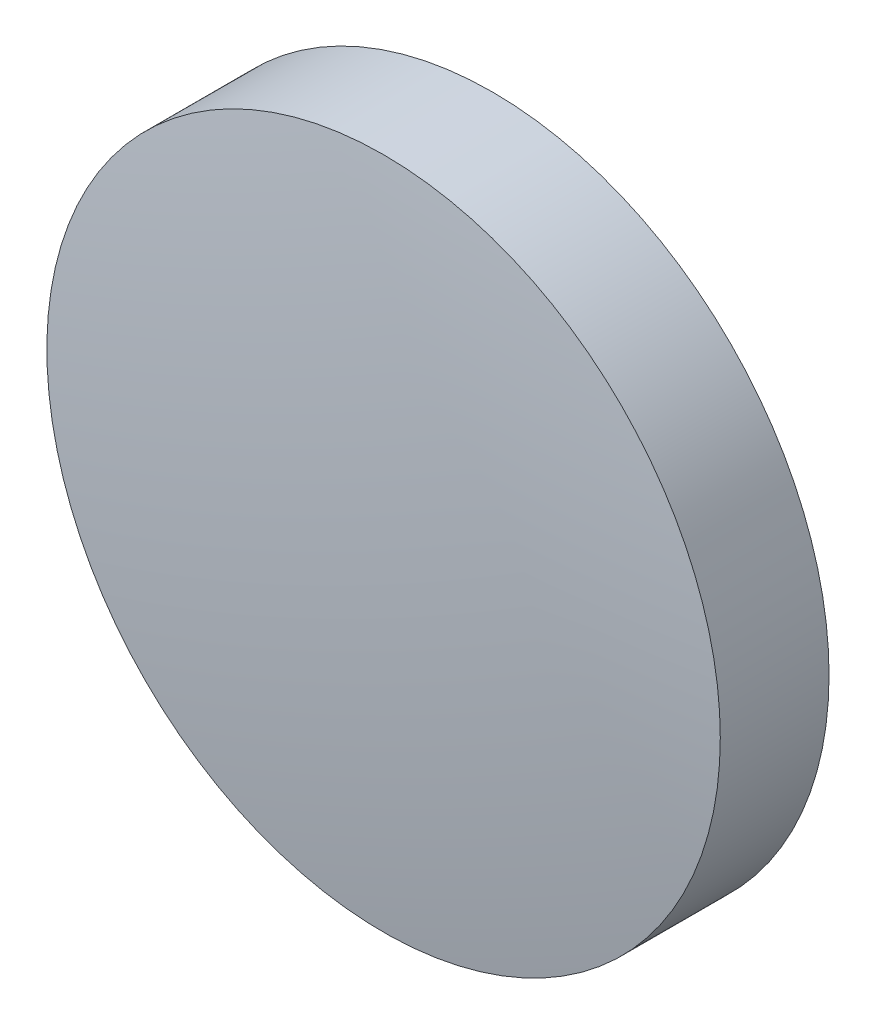
ISO-10303-21;
HEADER;
FILE_DESCRIPTION(('STEP AP214'),'2;1');
FILE_NAME('part.step','',(''),(''),'','','');
FILE_SCHEMA(('AUTOMOTIVE_DESIGN { 1 0 10303 214 1 1 1 1 }'));
ENDSEC;
DATA;
#1=APPLICATION_CONTEXT('core data for automotive mechanical design processes');
#2=APPLICATION_PROTOCOL_DEFINITION('international standard','automotive_design',2000,#1);
#3=PRODUCT_CONTEXT('',#1,'mechanical');
#4=PRODUCT('Part','Part','',(#3));
#5=PRODUCT_RELATED_PRODUCT_CATEGORY('part','',(#4));
#6=PRODUCT_DEFINITION_FORMATION('','',#4);
#7=PRODUCT_DEFINITION_CONTEXT('part definition',#1,'design');
#8=PRODUCT_DEFINITION('design','',#6,#7);
#9=PRODUCT_DEFINITION_SHAPE('','',#8);
#10=(LENGTH_UNIT() NAMED_UNIT(*) SI_UNIT(.MILLI.,.METRE.));
#11=(NAMED_UNIT(*) PLANE_ANGLE_UNIT() SI_UNIT($,.RADIAN.));
#12=(NAMED_UNIT(*) SI_UNIT($,.STERADIAN.) SOLID_ANGLE_UNIT());
#13=UNCERTAINTY_MEASURE_WITH_UNIT(LENGTH_MEASURE(1.E-05),#10,'distance_accuracy_value','');
#14=(GEOMETRIC_REPRESENTATION_CONTEXT(3) GLOBAL_UNCERTAINTY_ASSIGNED_CONTEXT((#13)) GLOBAL_UNIT_ASSIGNED_CONTEXT((#10,
#11,#12)) REPRESENTATION_CONTEXT('',''));
#15=CARTESIAN_POINT('',(0.,0.,0.));
#16=DIRECTION('',(0.,0.,1.));
#17=DIRECTION('',(1.,0.,0.));
#18=AXIS2_PLACEMENT_3D('',#15,#16,#17);
#19=CARTESIAN_POINT('',(0.,0.,-97.5441310755511));
#20=DIRECTION('',(0.,0.,1.));
#21=DIRECTION('',(0.,1.,0.));
#22=AXIS2_PLACEMENT_3D('',#19,#20,#21);
#23=SPHERICAL_SURFACE('',#22,100.);
#24=CARTESIAN_POINT('',(0.,0.,1.64614062485312));
#25=DIRECTION('',(0.,0.,1.));
#26=DIRECTION('',(1.,0.,0.));
#27=AXIS2_PLACEMENT_3D('',#24,#25,#26);
#28=CIRCLE('',#27,12.7);
#29=CARTESIAN_POINT('',(12.7,0.,1.64614062485312));
#30=VERTEX_POINT('',#29);
#31=EDGE_CURVE('E8',#30,#30,#28,.T.);
#32=ORIENTED_EDGE('',*,*,#31,.T.);
#33=EDGE_LOOP('',(#32));
#34=FACE_BOUND('',#33,.T.);
#35=ADVANCED_FACE('F12',(#34),#23,.T.);
#36=CARTESIAN_POINT('',(0.,0.,9.86097267929));
#37=DIRECTION('',(0.,0.,1.));
#38=DIRECTION('',(1.,0.,0.));
#39=AXIS2_PLACEMENT_3D('',#36,#37,#38);
#40=CYLINDRICAL_SURFACE('',#39,12.7);
#41=ORIENTED_EDGE('',*,*,#31,.F.);
#42=EDGE_LOOP('',(#41));
#43=FACE_BOUND('',#42,.T.);
#44=CARTESIAN_POINT('',(0.,0.,-2.45586892444894));
#45=DIRECTION('',(0.,0.,1.));
#46=DIRECTION('',(1.,0.,0.));
#47=AXIS2_PLACEMENT_3D('',#44,#45,#46);
#48=CIRCLE('',#47,12.7);
#49=CARTESIAN_POINT('',(12.7,0.,-2.45586892444894));
#50=VERTEX_POINT('',#49);
#51=EDGE_CURVE('E18',#50,#50,#48,.T.);
#52=ORIENTED_EDGE('',*,*,#51,.T.);
#53=EDGE_LOOP('',(#52));
#54=FACE_BOUND('',#53,.T.);
#55=ADVANCED_FACE('F24',(#43,#54),#40,.T.);
#56=CARTESIAN_POINT('',(0.,0.,-43.6841310755511));
#57=DIRECTION('',(0.,0.,1.));
#58=DIRECTION('',(0.,1.,0.));
#59=AXIS2_PLACEMENT_3D('',#56,#57,#58);
#60=SPHERICAL_SURFACE('',#59,43.14);
#61=ORIENTED_EDGE('',*,*,#51,.F.);
#62=EDGE_LOOP('',(#61));
#63=FACE_BOUND('',#62,.T.);
#64=ADVANCED_FACE('F26',(#63),#60,.F.);
#65=CLOSED_SHELL('',(#35,#55,#64));
#66=MANIFOLD_SOLID_BREP('B1',#65);
#67=ADVANCED_BREP_SHAPE_REPRESENTATION('',(#18,#66),#14);
#68=SHAPE_DEFINITION_REPRESENTATION(#9,#67);
ENDSEC;
END-ISO-10303-21;
